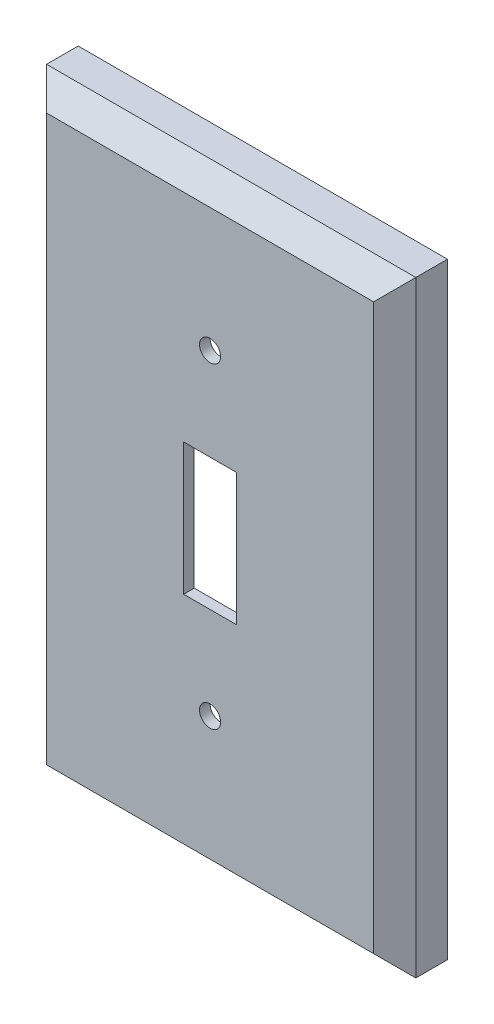
ISO-10303-21;
HEADER;
FILE_DESCRIPTION(('STEP AP214'),'2;1');
FILE_NAME('part.step','',(''),(''),'','','');
FILE_SCHEMA(('AUTOMOTIVE_DESIGN { 1 0 10303 214 1 1 1 1 }'));
ENDSEC;
DATA;
#1=APPLICATION_CONTEXT('core data for automotive mechanical design processes');
#2=APPLICATION_PROTOCOL_DEFINITION('international standard','automotive_design',2000,#1);
#3=PRODUCT_CONTEXT('',#1,'mechanical');
#4=PRODUCT('Part','Part','',(#3));
#5=PRODUCT_RELATED_PRODUCT_CATEGORY('part','',(#4));
#6=PRODUCT_DEFINITION_FORMATION('','',#4);
#7=PRODUCT_DEFINITION_CONTEXT('part definition',#1,'design');
#8=PRODUCT_DEFINITION('design','',#6,#7);
#9=PRODUCT_DEFINITION_SHAPE('','',#8);
#10=(LENGTH_UNIT() NAMED_UNIT(*) SI_UNIT(.MILLI.,.METRE.));
#11=(NAMED_UNIT(*) PLANE_ANGLE_UNIT() SI_UNIT($,.RADIAN.));
#12=(NAMED_UNIT(*) SI_UNIT($,.STERADIAN.) SOLID_ANGLE_UNIT());
#13=UNCERTAINTY_MEASURE_WITH_UNIT(LENGTH_MEASURE(1.E-05),#10,'distance_accuracy_value','');
#14=(GEOMETRIC_REPRESENTATION_CONTEXT(3) GLOBAL_UNCERTAINTY_ASSIGNED_CONTEXT((#13)) GLOBAL_UNIT_ASSIGNED_CONTEXT((#10,
#11,#12)) REPRESENTATION_CONTEXT('',''));
#15=CARTESIAN_POINT('',(0.,0.,0.));
#16=DIRECTION('',(0.,0.,1.));
#17=DIRECTION('',(1.,0.,0.));
#18=AXIS2_PLACEMENT_3D('',#15,#16,#17);
#19=CARTESIAN_POINT('',(0.,62.5000515388233,-62.4999484611454));
#20=DIRECTION('',(0.,-5.96994675916562E-13,1.));
#21=DIRECTION('',(0.,-1.,-5.96994675916562E-13));
#22=AXIS2_PLACEMENT_3D('',#19,#20,#21);
#23=PLANE('',#22);
#24=DIRECTION('',(0.,1.,5.96994675916562E-13));
#25=VECTOR('',#24,1.);
#26=CARTESIAN_POINT('',(0.,62.5000515388233,-62.4999484611454));
#27=LINE('',#26,#25);
#28=CARTESIAN_POINT('',(0.,-52.4999484611767,-62.499948461214));
#29=VERTEX_POINT('',#28);
#30=CARTESIAN_POINT('',(0.,62.5000515388233,-62.4999484611454));
#31=VERTEX_POINT('',#30);
#32=EDGE_CURVE('E188',#29,#31,#27,.T.);
#33=ORIENTED_EDGE('',*,*,#32,.T.);
#34=DIRECTION('',(1.,0.,0.));
#35=VECTOR('',#34,1.);
#36=CARTESIAN_POINT('',(0.,62.5000515388233,-62.4999484611454));
#37=LINE('',#36,#35);
#38=CARTESIAN_POINT('',(70.,62.5000515388233,-62.4999484611454));
#39=VERTEX_POINT('',#38);
#40=EDGE_CURVE('E233',#31,#39,#37,.T.);
#41=ORIENTED_EDGE('',*,*,#40,.T.);
#42=DIRECTION('',(0.,-1.,-5.96994675916562E-13));
#43=VECTOR('',#42,1.);
#44=CARTESIAN_POINT('',(70.,62.5000515388233,-62.4999484611454));
#45=LINE('',#44,#43);
#46=CARTESIAN_POINT('',(70.,-52.4999484611767,-62.499948461214));
#47=VERTEX_POINT('',#46);
#48=EDGE_CURVE('E235',#39,#47,#45,.T.);
#49=ORIENTED_EDGE('',*,*,#48,.T.);
#50=DIRECTION('',(-1.,0.,0.));
#51=VECTOR('',#50,1.);
#52=CARTESIAN_POINT('',(0.,-52.4999484611767,-62.499948461214));
#53=LINE('',#52,#51);
#54=EDGE_CURVE('E237',#47,#29,#53,.T.);
#55=ORIENTED_EDGE('',*,*,#54,.T.);
#56=EDGE_LOOP('',(#33,#41,#49,#55));
#57=FACE_BOUND('',#56,.T.);
#58=DIRECTION('',(-1.,0.,0.));
#59=VECTOR('',#58,1.);
#60=CARTESIAN_POINT('',(68.,-50.4999484611767,-62.4999484612128));
#61=LINE('',#60,#59);
#62=CARTESIAN_POINT('',(68.,-50.4999484611767,-62.4999484612128));
#63=VERTEX_POINT('',#62);
#64=CARTESIAN_POINT('',(2.,-50.4999484611767,-62.4999484612128));
#65=VERTEX_POINT('',#64);
#66=EDGE_CURVE('E178',#63,#65,#61,.T.);
#67=ORIENTED_EDGE('',*,*,#66,.F.);
#68=DIRECTION('',(0.,-1.,-5.96994675916562E-13));
#69=VECTOR('',#68,1.);
#70=CARTESIAN_POINT('',(68.,60.5000515388234,-62.4999484611465));
#71=LINE('',#70,#69);
#72=CARTESIAN_POINT('',(68.,60.5000515388234,-62.4999484611465));
#73=VERTEX_POINT('',#72);
#74=EDGE_CURVE('E212',#73,#63,#71,.T.);
#75=ORIENTED_EDGE('',*,*,#74,.F.);
#76=DIRECTION('',(1.,0.,0.));
#77=VECTOR('',#76,1.);
#78=CARTESIAN_POINT('',(2.,60.5000515388234,-62.4999484611465));
#79=LINE('',#78,#77);
#80=CARTESIAN_POINT('',(2.,60.5000515388234,-62.4999484611465));
#81=VERTEX_POINT('',#80);
#82=EDGE_CURVE('E195',#81,#73,#79,.T.);
#83=ORIENTED_EDGE('',*,*,#82,.F.);
#84=DIRECTION('',(0.,1.,5.96994675916562E-13));
#85=VECTOR('',#84,1.);
#86=CARTESIAN_POINT('',(2.,-50.4999484611767,-62.4999484612128));
#87=LINE('',#86,#85);
#88=EDGE_CURVE('E185',#65,#81,#87,.T.);
#89=ORIENTED_EDGE('',*,*,#88,.F.);
#90=EDGE_LOOP('',(#67,#75,#83,#89));
#91=FACE_BOUND('',#90,.T.);
#92=ADVANCED_FACE('F35',(#57,#91),#23,.F.);
#93=CARTESIAN_POINT('',(0.,62.5000515388233,-62.4999484611454));
#94=DIRECTION('',(1.,0.,0.));
#95=DIRECTION('',(0.,-1.,-5.96994675916562E-13));
#96=AXIS2_PLACEMENT_3D('',#93,#94,#95);
#97=PLANE('',#96);
#98=DIRECTION('',(0.,-5.96994675916562E-13,1.));
#99=VECTOR('',#98,1.);
#100=CARTESIAN_POINT('',(0.,-52.4999484611767,-62.499948461214));
#101=LINE('',#100,#99);
#102=CARTESIAN_POINT('',(0.,-52.4999484611802,-56.499948461214));
#103=VERTEX_POINT('',#102);
#104=EDGE_CURVE('E239',#29,#103,#101,.T.);
#105=ORIENTED_EDGE('',*,*,#104,.T.);
#106=DIRECTION('',(0.,1.,5.96994675916562E-13));
#107=VECTOR('',#106,1.);
#108=CARTESIAN_POINT('',(0.,62.5000515388198,-56.4999484611454));
#109=LINE('',#108,#107);
#110=CARTESIAN_POINT('',(0.,62.5000515388198,-56.4999484611454));
#111=VERTEX_POINT('',#110);
#112=EDGE_CURVE('E263',#103,#111,#109,.T.);
#113=ORIENTED_EDGE('',*,*,#112,.T.);
#114=DIRECTION('',(0.,-5.96994675916562E-13,1.));
#115=VECTOR('',#114,1.);
#116=CARTESIAN_POINT('',(0.,62.5000515388233,-62.4999484611454));
#117=LINE('',#116,#115);
#118=EDGE_CURVE('E248',#31,#111,#117,.T.);
#119=ORIENTED_EDGE('',*,*,#118,.F.);
#120=ORIENTED_EDGE('',*,*,#32,.F.);
#121=EDGE_LOOP('',(#105,#113,#119,#120));
#122=FACE_BOUND('',#121,.T.);
#123=ADVANCED_FACE('F312',(#122),#97,.F.);
#124=CARTESIAN_POINT('',(0.,62.5000515388233,-62.4999484611454));
#125=DIRECTION('',(0.,-1.,-5.96994675916562E-13));
#126=DIRECTION('',(-1.,0.,0.));
#127=AXIS2_PLACEMENT_3D('',#124,#125,#126);
#128=PLANE('',#127);
#129=ORIENTED_EDGE('',*,*,#118,.T.);
#130=DIRECTION('',(1.,0.,0.));
#131=VECTOR('',#130,1.);
#132=CARTESIAN_POINT('',(70.,62.5000515388198,-56.4999484611454));
#133=LINE('',#132,#131);
#134=CARTESIAN_POINT('',(70.,62.5000515388198,-56.4999484611454));
#135=VERTEX_POINT('',#134);
#136=EDGE_CURVE('E265',#111,#135,#133,.T.);
#137=ORIENTED_EDGE('',*,*,#136,.T.);
#138=DIRECTION('',(0.,-5.96994675916562E-13,1.));
#139=VECTOR('',#138,1.);
#140=CARTESIAN_POINT('',(70.,62.5000515388233,-62.4999484611454));
#141=LINE('',#140,#139);
#142=EDGE_CURVE('E245',#39,#135,#141,.T.);
#143=ORIENTED_EDGE('',*,*,#142,.F.);
#144=ORIENTED_EDGE('',*,*,#40,.F.);
#145=EDGE_LOOP('',(#129,#137,#143,#144));
#146=FACE_BOUND('',#145,.T.);
#147=ADVANCED_FACE('F326',(#146),#128,.F.);
#148=CARTESIAN_POINT('',(70.,62.5000515388233,-62.4999484611454));
#149=DIRECTION('',(-1.,0.,0.));
#150=DIRECTION('',(0.,1.,5.96994675916562E-13));
#151=AXIS2_PLACEMENT_3D('',#148,#149,#150);
#152=PLANE('',#151);
#153=ORIENTED_EDGE('',*,*,#142,.T.);
#154=DIRECTION('',(0.,-1.,-5.96994675916562E-13));
#155=VECTOR('',#154,1.);
#156=CARTESIAN_POINT('',(70.,-52.4999484611802,-56.499948461214));
#157=LINE('',#156,#155);
#158=CARTESIAN_POINT('',(70.,-52.4999484611802,-56.499948461214));
#159=VERTEX_POINT('',#158);
#160=EDGE_CURVE('E267',#135,#159,#157,.T.);
#161=ORIENTED_EDGE('',*,*,#160,.T.);
#162=DIRECTION('',(0.,-5.96994675916562E-13,1.));
#163=VECTOR('',#162,1.);
#164=CARTESIAN_POINT('',(70.,-52.4999484611767,-62.499948461214));
#165=LINE('',#164,#163);
#166=EDGE_CURVE('E242',#47,#159,#165,.T.);
#167=ORIENTED_EDGE('',*,*,#166,.F.);
#168=ORIENTED_EDGE('',*,*,#48,.F.);
#169=EDGE_LOOP('',(#153,#161,#167,#168));
#170=FACE_BOUND('',#169,.T.);
#171=ADVANCED_FACE('F318',(#170),#152,.F.);
#172=CARTESIAN_POINT('',(0.,-52.4999484611767,-62.499948461214));
#173=DIRECTION('',(0.,1.,5.96994675916562E-13));
#174=DIRECTION('',(1.,0.,0.));
#175=AXIS2_PLACEMENT_3D('',#172,#173,#174);
#176=PLANE('',#175);
#177=ORIENTED_EDGE('',*,*,#166,.T.);
#178=DIRECTION('',(-1.,0.,0.));
#179=VECTOR('',#178,1.);
#180=CARTESIAN_POINT('',(0.,-52.4999484611802,-56.499948461214));
#181=LINE('',#180,#179);
#182=EDGE_CURVE('E251',#159,#103,#181,.T.);
#183=ORIENTED_EDGE('',*,*,#182,.T.);
#184=ORIENTED_EDGE('',*,*,#104,.F.);
#185=ORIENTED_EDGE('',*,*,#54,.F.);
#186=EDGE_LOOP('',(#177,#183,#184,#185));
#187=FACE_BOUND('',#186,.T.);
#188=ADVANCED_FACE('F288',(#187),#176,.F.);
#189=CARTESIAN_POINT('',(0.,62.5000515388174,-52.4999484611454));
#190=DIRECTION('',(0.,-5.96994675916562E-13,1.));
#191=DIRECTION('',(0.,-1.,-5.96994675916562E-13));
#192=AXIS2_PLACEMENT_3D('',#189,#190,#191);
#193=PLANE('',#192);
#194=CARTESIAN_POINT('',(35.,-24.9999484611826,-52.4999484611976));
#195=DIRECTION('',(0.,-5.96994675916562E-13,1.));
#196=DIRECTION('',(0.,-1.,-5.96994675916562E-13));
#197=AXIS2_PLACEMENT_3D('',#194,#195,#196);
#198=CIRCLE('',#197,2.);
#199=CARTESIAN_POINT('',(35.,-26.9999484611826,-52.4999484611988));
#200=VERTEX_POINT('',#199);
#201=EDGE_CURVE('E169',#200,#200,#198,.T.);
#202=ORIENTED_EDGE('',*,*,#201,.F.);
#203=EDGE_LOOP('',(#202));
#204=FACE_BOUND('',#203,.T.);
#205=CARTESIAN_POINT('',(35.,35.0000515388174,-52.4999484611618));
#206=DIRECTION('',(0.,-5.96994675916562E-13,1.));
#207=DIRECTION('',(0.,-1.,-5.96994675916562E-13));
#208=AXIS2_PLACEMENT_3D('',#205,#206,#207);
#209=CIRCLE('',#208,2.);
#210=CARTESIAN_POINT('',(35.,33.0000515388174,-52.499948461163));
#211=VERTEX_POINT('',#210);
#212=EDGE_CURVE('E166',#211,#211,#209,.T.);
#213=ORIENTED_EDGE('',*,*,#212,.F.);
#214=EDGE_LOOP('',(#213));
#215=FACE_BOUND('',#214,.T.);
#216=DIRECTION('',(0.,-1.,-5.96994675916562E-13));
#217=VECTOR('',#216,1.);
#218=CARTESIAN_POINT('',(30.,62.5000515388174,-52.4999484611454));
#219=LINE('',#218,#217);
#220=CARTESIAN_POINT('',(30.,17.5000515388174,-52.4999484611722));
#221=VERTEX_POINT('',#220);
#222=CARTESIAN_POINT('',(30.,-7.49994846118263,-52.4999484611871));
#223=VERTEX_POINT('',#222);
#224=EDGE_CURVE('E12',#221,#223,#219,.T.);
#225=ORIENTED_EDGE('',*,*,#224,.F.);
#226=DIRECTION('',(-1.,0.,0.));
#227=VECTOR('',#226,1.);
#228=CARTESIAN_POINT('',(0.,17.5000515388174,-52.4999484611722));
#229=LINE('',#228,#227);
#230=CARTESIAN_POINT('',(40.,17.5000515388174,-52.4999484611722));
#231=VERTEX_POINT('',#230);
#232=EDGE_CURVE('E140',#231,#221,#229,.T.);
#233=ORIENTED_EDGE('',*,*,#232,.F.);
#234=DIRECTION('',(0.,1.,5.96994675916562E-13));
#235=VECTOR('',#234,1.);
#236=CARTESIAN_POINT('',(40.,62.5000515388174,-52.4999484611454));
#237=LINE('',#236,#235);
#238=CARTESIAN_POINT('',(40.,-7.49994846118263,-52.4999484611871));
#239=VERTEX_POINT('',#238);
#240=EDGE_CURVE('E278',#239,#231,#237,.T.);
#241=ORIENTED_EDGE('',*,*,#240,.F.);
#242=DIRECTION('',(1.,0.,0.));
#243=VECTOR('',#242,1.);
#244=CARTESIAN_POINT('',(0.,-7.49994846118263,-52.4999484611871));
#245=LINE('',#244,#243);
#246=EDGE_CURVE('E43',#223,#239,#245,.T.);
#247=ORIENTED_EDGE('',*,*,#246,.F.);
#248=EDGE_LOOP('',(#225,#233,#241,#247));
#249=FACE_BOUND('',#248,.T.);
#250=DIRECTION('',(0.,-1.,-5.96994675916562E-13));
#251=VECTOR('',#250,1.);
#252=CARTESIAN_POINT('',(4.00000000000003,-52.4999484611826,-52.499948461214));
#253=LINE('',#252,#251);
#254=CARTESIAN_POINT('',(4.00000000000003,58.5000515388174,-52.4999484611477));
#255=VERTEX_POINT('',#254);
#256=CARTESIAN_POINT('',(4.00000000000003,-48.4999484611826,-52.4999484612116));
#257=VERTEX_POINT('',#256);
#258=EDGE_CURVE('E258',#255,#257,#253,.T.);
#259=ORIENTED_EDGE('',*,*,#258,.T.);
#260=DIRECTION('',(1.,0.,0.));
#261=VECTOR('',#260,1.);
#262=CARTESIAN_POINT('',(70.,-48.4999484611826,-52.4999484612116));
#263=LINE('',#262,#261);
#264=CARTESIAN_POINT('',(66.,-48.4999484611826,-52.4999484612116));
#265=VERTEX_POINT('',#264);
#266=EDGE_CURVE('E260',#257,#265,#263,.T.);
#267=ORIENTED_EDGE('',*,*,#266,.T.);
#268=DIRECTION('',(0.,1.,5.96994675916562E-13));
#269=VECTOR('',#268,1.);
#270=CARTESIAN_POINT('',(66.,62.5000515388174,-52.4999484611454));
#271=LINE('',#270,#269);
#272=CARTESIAN_POINT('',(66.,58.5000515388174,-52.4999484611477));
#273=VERTEX_POINT('',#272);
#274=EDGE_CURVE('E254',#265,#273,#271,.T.);
#275=ORIENTED_EDGE('',*,*,#274,.T.);
#276=DIRECTION('',(-1.,0.,0.));
#277=VECTOR('',#276,1.);
#278=CARTESIAN_POINT('',(0.,58.5000515388174,-52.4999484611477));
#279=LINE('',#278,#277);
#280=EDGE_CURVE('E256',#273,#255,#279,.T.);
#281=ORIENTED_EDGE('',*,*,#280,.T.);
#282=EDGE_LOOP('',(#259,#267,#275,#281));
#283=FACE_BOUND('',#282,.T.);
#284=ADVANCED_FACE('F285',(#204,#215,#249,#283),#193,.T.);
#285=CARTESIAN_POINT('',(0.,62.5000515388186,-54.4999484611454));
#286=DIRECTION('',(0.,5.96994675916562E-13,-1.));
#287=DIRECTION('',(0.,1.,5.96994675916562E-13));
#288=AXIS2_PLACEMENT_3D('',#285,#286,#287);
#289=PLANE('',#288);
#290=DIRECTION('',(0.,1.,5.96994675916562E-13));
#291=VECTOR('',#290,1.);
#292=CARTESIAN_POINT('',(30.,-7.49994846118143,-54.4999484611871));
#293=LINE('',#292,#291);
#294=CARTESIAN_POINT('',(30.,-7.49994846118143,-54.4999484611871));
#295=VERTEX_POINT('',#294);
#296=CARTESIAN_POINT('',(30.,17.5000515388186,-54.4999484611722));
#297=VERTEX_POINT('',#296);
#298=EDGE_CURVE('E146',#295,#297,#293,.T.);
#299=ORIENTED_EDGE('',*,*,#298,.F.);
#300=DIRECTION('',(-1.,0.,0.));
#301=VECTOR('',#300,1.);
#302=CARTESIAN_POINT('',(30.,-7.49994846118143,-54.4999484611871));
#303=LINE('',#302,#301);
#304=CARTESIAN_POINT('',(40.,-7.49994846118143,-54.4999484611871));
#305=VERTEX_POINT('',#304);
#306=EDGE_CURVE('E143',#305,#295,#303,.T.);
#307=ORIENTED_EDGE('',*,*,#306,.F.);
#308=DIRECTION('',(0.,-1.,-5.96994675916562E-13));
#309=VECTOR('',#308,1.);
#310=CARTESIAN_POINT('',(40.,-7.49994846118143,-54.4999484611871));
#311=LINE('',#310,#309);
#312=CARTESIAN_POINT('',(40.,17.5000515388186,-54.4999484611722));
#313=VERTEX_POINT('',#312);
#314=EDGE_CURVE('E57',#313,#305,#311,.T.);
#315=ORIENTED_EDGE('',*,*,#314,.F.);
#316=DIRECTION('',(1.,0.,0.));
#317=VECTOR('',#316,1.);
#318=CARTESIAN_POINT('',(30.,17.5000515388186,-54.4999484611722));
#319=LINE('',#318,#317);
#320=EDGE_CURVE('E138',#297,#313,#319,.T.);
#321=ORIENTED_EDGE('',*,*,#320,.F.);
#322=EDGE_LOOP('',(#299,#307,#315,#321));
#323=FACE_BOUND('',#322,.T.);
#324=CARTESIAN_POINT('',(35.,-24.9999484611814,-54.4999484611976));
#325=DIRECTION('',(0.,5.96994675916562E-13,-1.));
#326=DIRECTION('',(0.,1.,5.96994675916562E-13));
#327=AXIS2_PLACEMENT_3D('',#324,#325,#326);
#328=CIRCLE('',#327,2.);
#329=CARTESIAN_POINT('',(35.,-22.9999484611814,-54.4999484611964));
#330=VERTEX_POINT('',#329);
#331=EDGE_CURVE('E170',#330,#330,#328,.T.);
#332=ORIENTED_EDGE('',*,*,#331,.F.);
#333=EDGE_LOOP('',(#332));
#334=FACE_BOUND('',#333,.T.);
#335=CARTESIAN_POINT('',(35.,35.0000515388186,-54.4999484611618));
#336=DIRECTION('',(0.,5.96994675916562E-13,-1.));
#337=DIRECTION('',(0.,1.,5.96994675916562E-13));
#338=AXIS2_PLACEMENT_3D('',#335,#336,#337);
#339=CIRCLE('',#338,2.);
#340=CARTESIAN_POINT('',(35.,37.0000515388186,-54.4999484611606));
#341=VERTEX_POINT('',#340);
#342=EDGE_CURVE('E162',#341,#341,#339,.T.);
#343=ORIENTED_EDGE('',*,*,#342,.F.);
#344=EDGE_LOOP('',(#343));
#345=FACE_BOUND('',#344,.T.);
#346=DIRECTION('',(-1.,0.,0.));
#347=VECTOR('',#346,1.);
#348=CARTESIAN_POINT('',(68.,-50.4999484611814,-54.4999484612128));
#349=LINE('',#348,#347);
#350=CARTESIAN_POINT('',(68.,-50.4999484611814,-54.4999484612128));
#351=VERTEX_POINT('',#350);
#352=CARTESIAN_POINT('',(2.,-50.4999484611814,-54.4999484612128));
#353=VERTEX_POINT('',#352);
#354=EDGE_CURVE('E203',#351,#353,#349,.T.);
#355=ORIENTED_EDGE('',*,*,#354,.T.);
#356=DIRECTION('',(0.,1.,5.96994675916562E-13));
#357=VECTOR('',#356,1.);
#358=CARTESIAN_POINT('',(2.,-50.4999484611814,-54.4999484612128));
#359=LINE('',#358,#357);
#360=CARTESIAN_POINT('',(2.,60.5000515388186,-54.4999484611465));
#361=VERTEX_POINT('',#360);
#362=EDGE_CURVE('E189',#353,#361,#359,.T.);
#363=ORIENTED_EDGE('',*,*,#362,.T.);
#364=DIRECTION('',(1.,0.,0.));
#365=VECTOR('',#364,1.);
#366=CARTESIAN_POINT('',(2.,60.5000515388186,-54.4999484611465));
#367=LINE('',#366,#365);
#368=CARTESIAN_POINT('',(68.,60.5000515388186,-54.4999484611465));
#369=VERTEX_POINT('',#368);
#370=EDGE_CURVE('E196',#361,#369,#367,.T.);
#371=ORIENTED_EDGE('',*,*,#370,.T.);
#372=DIRECTION('',(0.,-1.,-5.96994675916562E-13));
#373=VECTOR('',#372,1.);
#374=CARTESIAN_POINT('',(68.,60.5000515388186,-54.4999484611465));
#375=LINE('',#374,#373);
#376=EDGE_CURVE('E177',#369,#351,#375,.T.);
#377=ORIENTED_EDGE('',*,*,#376,.T.);
#378=EDGE_LOOP('',(#355,#363,#371,#377));
#379=FACE_BOUND('',#378,.T.);
#380=ADVANCED_FACE('F154',(#323,#334,#345,#379),#289,.T.);
#381=CARTESIAN_POINT('',(68.,-50.4999484611767,-62.4999484612128));
#382=DIRECTION('',(0.,1.,5.96994675916562E-13));
#383=DIRECTION('',(1.,0.,0.));
#384=AXIS2_PLACEMENT_3D('',#381,#382,#383);
#385=PLANE('',#384);
#386=ORIENTED_EDGE('',*,*,#354,.F.);
#387=DIRECTION('',(0.,-5.96994675916562E-13,1.));
#388=VECTOR('',#387,1.);
#389=CARTESIAN_POINT('',(68.,-50.4999484611767,-62.4999484612128));
#390=LINE('',#389,#388);
#391=EDGE_CURVE('E182',#63,#351,#390,.T.);
#392=ORIENTED_EDGE('',*,*,#391,.F.);
#393=ORIENTED_EDGE('',*,*,#66,.T.);
#394=DIRECTION('',(0.,-5.96994675916562E-13,1.));
#395=VECTOR('',#394,1.);
#396=CARTESIAN_POINT('',(2.,-50.4999484611767,-62.4999484612128));
#397=LINE('',#396,#395);
#398=EDGE_CURVE('E174',#65,#353,#397,.T.);
#399=ORIENTED_EDGE('',*,*,#398,.T.);
#400=EDGE_LOOP('',(#386,#392,#393,#399));
#401=FACE_BOUND('',#400,.T.);
#402=ADVANCED_FACE('F359',(#401),#385,.T.);
#403=CARTESIAN_POINT('',(68.,60.5000515388234,-62.4999484611465));
#404=DIRECTION('',(-1.,0.,0.));
#405=DIRECTION('',(0.,1.,5.96994675916562E-13));
#406=AXIS2_PLACEMENT_3D('',#403,#404,#405);
#407=PLANE('',#406);
#408=ORIENTED_EDGE('',*,*,#376,.F.);
#409=DIRECTION('',(0.,-5.96994675916562E-13,1.));
#410=VECTOR('',#409,1.);
#411=CARTESIAN_POINT('',(68.,60.5000515388234,-62.4999484611465));
#412=LINE('',#411,#410);
#413=EDGE_CURVE('E215',#73,#369,#412,.T.);
#414=ORIENTED_EDGE('',*,*,#413,.F.);
#415=ORIENTED_EDGE('',*,*,#74,.T.);
#416=ORIENTED_EDGE('',*,*,#391,.T.);
#417=EDGE_LOOP('',(#408,#414,#415,#416));
#418=FACE_BOUND('',#417,.T.);
#419=ADVANCED_FACE('F366',(#418),#407,.T.);
#420=CARTESIAN_POINT('',(2.,60.5000515388234,-62.4999484611465));
#421=DIRECTION('',(0.,-1.,-5.96994675916562E-13));
#422=DIRECTION('',(-1.,0.,0.));
#423=AXIS2_PLACEMENT_3D('',#420,#421,#422);
#424=PLANE('',#423);
#425=ORIENTED_EDGE('',*,*,#370,.F.);
#426=DIRECTION('',(0.,-5.96994675916562E-13,1.));
#427=VECTOR('',#426,1.);
#428=CARTESIAN_POINT('',(2.,60.5000515388234,-62.4999484611465));
#429=LINE('',#428,#427);
#430=EDGE_CURVE('E192',#81,#361,#429,.T.);
#431=ORIENTED_EDGE('',*,*,#430,.F.);
#432=ORIENTED_EDGE('',*,*,#82,.T.);
#433=ORIENTED_EDGE('',*,*,#413,.T.);
#434=EDGE_LOOP('',(#425,#431,#432,#433));
#435=FACE_BOUND('',#434,.T.);
#436=ADVANCED_FACE('F375',(#435),#424,.T.);
#437=CARTESIAN_POINT('',(2.,-50.4999484611767,-62.4999484612128));
#438=DIRECTION('',(1.,0.,0.));
#439=DIRECTION('',(0.,-1.,-5.96994675916562E-13));
#440=AXIS2_PLACEMENT_3D('',#437,#438,#439);
#441=PLANE('',#440);
#442=ORIENTED_EDGE('',*,*,#362,.F.);
#443=ORIENTED_EDGE('',*,*,#398,.F.);
#444=ORIENTED_EDGE('',*,*,#88,.T.);
#445=ORIENTED_EDGE('',*,*,#430,.T.);
#446=EDGE_LOOP('',(#442,#443,#444,#445));
#447=FACE_BOUND('',#446,.T.);
#448=ADVANCED_FACE('F291',(#447),#441,.T.);
#449=CARTESIAN_POINT('',(0.,62.5000515388198,-56.4999484611454));
#450=DIRECTION('',(0.,0.707106781186125,0.70710678118697));
#451=DIRECTION('',(-1.,0.,0.));
#452=AXIS2_PLACEMENT_3D('',#449,#450,#451);
#453=PLANE('',#452);
#454=DIRECTION('',(0.577350269189626,-0.57735026918997,0.577350269189281));
#455=VECTOR('',#454,1.);
#456=CARTESIAN_POINT('',(0.,62.5000515388198,-56.4999484611454));
#457=LINE('',#456,#455);
#458=EDGE_CURVE('E272',#255,#111,#457,.F.);
#459=ORIENTED_EDGE('',*,*,#458,.F.);
#460=ORIENTED_EDGE('',*,*,#280,.F.);
#461=DIRECTION('',(-0.577350269189626,-0.57735026918997,0.577350269189281));
#462=VECTOR('',#461,1.);
#463=CARTESIAN_POINT('',(70.,62.5000515388198,-56.4999484611454));
#464=LINE('',#463,#462);
#465=EDGE_CURVE('E205',#135,#273,#464,.T.);
#466=ORIENTED_EDGE('',*,*,#465,.F.);
#467=ORIENTED_EDGE('',*,*,#136,.F.);
#468=EDGE_LOOP('',(#459,#460,#466,#467));
#469=FACE_BOUND('',#468,.T.);
#470=ADVANCED_FACE('F37',(#469),#453,.T.);
#471=CARTESIAN_POINT('',(70.,62.5000515388198,-56.4999484611454));
#472=DIRECTION('',(0.707106781186547,-4.22138983672866E-13,0.707106781186547));
#473=DIRECTION('',(0.,1.,5.96994675916562E-13));
#474=AXIS2_PLACEMENT_3D('',#471,#472,#473);
#475=PLANE('',#474);
#476=ORIENTED_EDGE('',*,*,#465,.T.);
#477=ORIENTED_EDGE('',*,*,#274,.F.);
#478=DIRECTION('',(0.577350269189626,-0.577350269189281,-0.57735026918997));
#479=VECTOR('',#478,1.);
#480=CARTESIAN_POINT('',(31.6666666666667,-14.1666151278698,-18.1666151278578));
#481=LINE('',#480,#479);
#482=EDGE_CURVE('E270',#159,#265,#481,.F.);
#483=ORIENTED_EDGE('',*,*,#482,.F.);
#484=ORIENTED_EDGE('',*,*,#160,.F.);
#485=EDGE_LOOP('',(#476,#477,#483,#484));
#486=FACE_BOUND('',#485,.T.);
#487=ADVANCED_FACE('F322',(#486),#475,.T.);
#488=CARTESIAN_POINT('',(0.,62.5000515388198,-56.4999484611454));
#489=DIRECTION('',(-0.707106781186547,-4.22138983672866E-13,0.707106781186547));
#490=DIRECTION('',(0.,-1.,-5.96994675916562E-13));
#491=AXIS2_PLACEMENT_3D('',#488,#489,#490);
#492=PLANE('',#491);
#493=ORIENTED_EDGE('',*,*,#458,.T.);
#494=ORIENTED_EDGE('',*,*,#112,.F.);
#495=DIRECTION('',(0.577350269189626,0.577350269189281,0.57735026918997));
#496=VECTOR('',#495,1.);
#497=CARTESIAN_POINT('',(38.3333333333333,-14.1666151278698,-18.1666151278578));
#498=LINE('',#497,#496);
#499=EDGE_CURVE('E173',#257,#103,#498,.F.);
#500=ORIENTED_EDGE('',*,*,#499,.F.);
#501=ORIENTED_EDGE('',*,*,#258,.F.);
#502=EDGE_LOOP('',(#493,#494,#500,#501));
#503=FACE_BOUND('',#502,.T.);
#504=ADVANCED_FACE('F304',(#503),#492,.T.);
#505=CARTESIAN_POINT('',(0.,-52.4999484611802,-56.499948461214));
#506=DIRECTION('',(0.,-0.70710678118697,0.707106781186125));
#507=DIRECTION('',(1.,0.,0.));
#508=AXIS2_PLACEMENT_3D('',#505,#506,#507);
#509=PLANE('',#508);
#510=ORIENTED_EDGE('',*,*,#482,.T.);
#511=ORIENTED_EDGE('',*,*,#266,.F.);
#512=ORIENTED_EDGE('',*,*,#499,.T.);
#513=ORIENTED_EDGE('',*,*,#182,.F.);
#514=EDGE_LOOP('',(#510,#511,#512,#513));
#515=FACE_BOUND('',#514,.T.);
#516=ADVANCED_FACE('F299',(#515),#509,.T.);
#517=CARTESIAN_POINT('',(35.,35.0000515388138,-46.4999484611618));
#518=DIRECTION('',(0.,5.96994675916562E-13,-1.));
#519=DIRECTION('',(0.,1.,5.96994675916562E-13));
#520=AXIS2_PLACEMENT_3D('',#517,#518,#519);
#521=CYLINDRICAL_SURFACE('',#520,2.);
#522=ORIENTED_EDGE('',*,*,#212,.T.);
#523=EDGE_LOOP('',(#522));
#524=FACE_BOUND('',#523,.T.);
#525=ORIENTED_EDGE('',*,*,#342,.T.);
#526=EDGE_LOOP('',(#525));
#527=FACE_BOUND('',#526,.T.);
#528=ADVANCED_FACE('F418',(#524,#527),#521,.F.);
#529=CARTESIAN_POINT('',(35.,-24.9999484611862,-46.4999484611976));
#530=DIRECTION('',(0.,5.96994675916562E-13,-1.));
#531=DIRECTION('',(0.,1.,5.96994675916562E-13));
#532=AXIS2_PLACEMENT_3D('',#529,#530,#531);
#533=CYLINDRICAL_SURFACE('',#532,2.);
#534=ORIENTED_EDGE('',*,*,#201,.T.);
#535=EDGE_LOOP('',(#534));
#536=FACE_BOUND('',#535,.T.);
#537=ORIENTED_EDGE('',*,*,#331,.T.);
#538=EDGE_LOOP('',(#537));
#539=FACE_BOUND('',#538,.T.);
#540=ADVANCED_FACE('F426',(#536,#539),#533,.F.);
#541=CARTESIAN_POINT('',(30.,-7.49994846118621,-46.4999484611871));
#542=DIRECTION('',(-1.,0.,0.));
#543=DIRECTION('',(0.,1.,5.96994675916562E-13));
#544=AXIS2_PLACEMENT_3D('',#541,#542,#543);
#545=PLANE('',#544);
#546=ORIENTED_EDGE('',*,*,#224,.T.);
#547=DIRECTION('',(0.,5.96994675916562E-13,-1.));
#548=VECTOR('',#547,1.);
#549=CARTESIAN_POINT('',(30.,-7.49994846118621,-46.4999484611871));
#550=LINE('',#549,#548);
#551=EDGE_CURVE('E149',#223,#295,#550,.T.);
#552=ORIENTED_EDGE('',*,*,#551,.T.);
#553=ORIENTED_EDGE('',*,*,#298,.T.);
#554=DIRECTION('',(0.,5.96994675916562E-13,-1.));
#555=VECTOR('',#554,1.);
#556=CARTESIAN_POINT('',(30.,17.5000515388138,-46.4999484611722));
#557=LINE('',#556,#555);
#558=EDGE_CURVE('E134',#221,#297,#557,.T.);
#559=ORIENTED_EDGE('',*,*,#558,.F.);
#560=EDGE_LOOP('',(#546,#552,#553,#559));
#561=FACE_BOUND('',#560,.T.);
#562=ADVANCED_FACE('F147',(#561),#545,.F.);
#563=CARTESIAN_POINT('',(30.,-7.49994846118621,-46.4999484611871));
#564=DIRECTION('',(0.,-1.,-5.96994675916562E-13));
#565=DIRECTION('',(-1.,0.,0.));
#566=AXIS2_PLACEMENT_3D('',#563,#564,#565);
#567=PLANE('',#566);
#568=ORIENTED_EDGE('',*,*,#246,.T.);
#569=DIRECTION('',(0.,5.96994675916562E-13,-1.));
#570=VECTOR('',#569,1.);
#571=CARTESIAN_POINT('',(40.,-7.49994846118621,-46.4999484611871));
#572=LINE('',#571,#570);
#573=EDGE_CURVE('E163',#239,#305,#572,.T.);
#574=ORIENTED_EDGE('',*,*,#573,.T.);
#575=ORIENTED_EDGE('',*,*,#306,.T.);
#576=ORIENTED_EDGE('',*,*,#551,.F.);
#577=EDGE_LOOP('',(#568,#574,#575,#576));
#578=FACE_BOUND('',#577,.T.);
#579=ADVANCED_FACE('F281',(#578),#567,.F.);
#580=CARTESIAN_POINT('',(40.,-7.49994846118621,-46.4999484611871));
#581=DIRECTION('',(1.,0.,0.));
#582=DIRECTION('',(0.,-1.,-5.96994675916562E-13));
#583=AXIS2_PLACEMENT_3D('',#580,#581,#582);
#584=PLANE('',#583);
#585=ORIENTED_EDGE('',*,*,#240,.T.);
#586=DIRECTION('',(0.,5.96994675916562E-13,-1.));
#587=VECTOR('',#586,1.);
#588=CARTESIAN_POINT('',(40.,17.5000515388138,-46.4999484611722));
#589=LINE('',#588,#587);
#590=EDGE_CURVE('E50',#231,#313,#589,.T.);
#591=ORIENTED_EDGE('',*,*,#590,.T.);
#592=ORIENTED_EDGE('',*,*,#314,.T.);
#593=ORIENTED_EDGE('',*,*,#573,.F.);
#594=EDGE_LOOP('',(#585,#591,#592,#593));
#595=FACE_BOUND('',#594,.T.);
#596=ADVANCED_FACE('F284',(#595),#584,.F.);
#597=CARTESIAN_POINT('',(30.,17.5000515388138,-46.4999484611722));
#598=DIRECTION('',(0.,1.,5.96994675916562E-13));
#599=DIRECTION('',(1.,0.,0.));
#600=AXIS2_PLACEMENT_3D('',#597,#598,#599);
#601=PLANE('',#600);
#602=ORIENTED_EDGE('',*,*,#232,.T.);
#603=ORIENTED_EDGE('',*,*,#558,.T.);
#604=ORIENTED_EDGE('',*,*,#320,.T.);
#605=ORIENTED_EDGE('',*,*,#590,.F.);
#606=EDGE_LOOP('',(#602,#603,#604,#605));
#607=FACE_BOUND('',#606,.T.);
#608=ADVANCED_FACE('F136',(#607),#601,.F.);
#609=CLOSED_SHELL('',(#92,#123,#147,#171,#188,#284,#380,#402,#419,#436,#448,#470,#487,#504,#516,
#528,#540,#562,#579,#596,#608));
#610=MANIFOLD_SOLID_BREP('B2',#609);
#611=ADVANCED_BREP_SHAPE_REPRESENTATION('',(#18,#610),#14);
#612=SHAPE_DEFINITION_REPRESENTATION(#9,#611);
ENDSEC;
END-ISO-10303-21;
